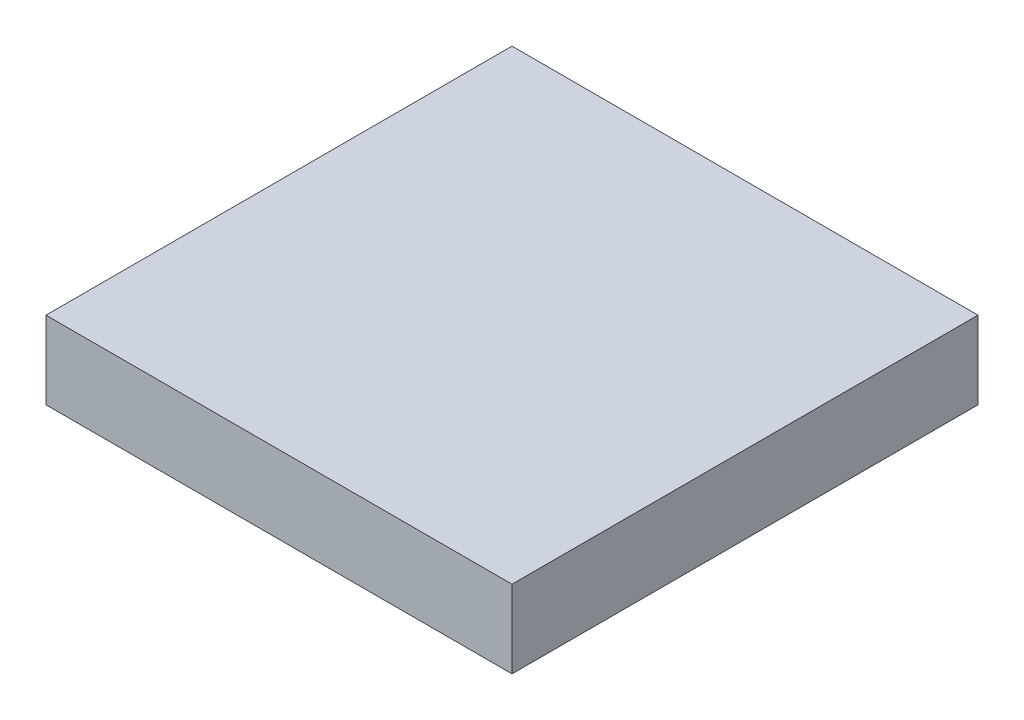
ISO-10303-21;
HEADER;
FILE_DESCRIPTION(('STEP AP214'),'2;1');
FILE_NAME('part.step','',(''),(''),'','','');
FILE_SCHEMA(('AUTOMOTIVE_DESIGN { 1 0 10303 214 1 1 1 1 }'));
ENDSEC;
DATA;
#1=APPLICATION_CONTEXT('core data for automotive mechanical design processes');
#2=APPLICATION_PROTOCOL_DEFINITION('international standard','automotive_design',2000,#1);
#3=PRODUCT_CONTEXT('',#1,'mechanical');
#4=PRODUCT('Part','Part','',(#3));
#5=PRODUCT_RELATED_PRODUCT_CATEGORY('part','',(#4));
#6=PRODUCT_DEFINITION_FORMATION('','',#4);
#7=PRODUCT_DEFINITION_CONTEXT('part definition',#1,'design');
#8=PRODUCT_DEFINITION('design','',#6,#7);
#9=PRODUCT_DEFINITION_SHAPE('','',#8);
#10=(LENGTH_UNIT() NAMED_UNIT(*) SI_UNIT(.MILLI.,.METRE.));
#11=(NAMED_UNIT(*) PLANE_ANGLE_UNIT() SI_UNIT($,.RADIAN.));
#12=(NAMED_UNIT(*) SI_UNIT($,.STERADIAN.) SOLID_ANGLE_UNIT());
#13=UNCERTAINTY_MEASURE_WITH_UNIT(LENGTH_MEASURE(1.E-05),#10,'distance_accuracy_value','');
#14=(GEOMETRIC_REPRESENTATION_CONTEXT(3) GLOBAL_UNCERTAINTY_ASSIGNED_CONTEXT((#13)) GLOBAL_UNIT_ASSIGNED_CONTEXT((#10,
#11,#12)) REPRESENTATION_CONTEXT('',''));
#15=CARTESIAN_POINT('',(0.,0.,0.));
#16=DIRECTION('',(0.,0.,1.));
#17=DIRECTION('',(1.,0.,0.));
#18=AXIS2_PLACEMENT_3D('',#15,#16,#17);
#19=CARTESIAN_POINT('',(15.,5.,-15.));
#20=DIRECTION('',(-1.,0.,0.));
#21=DIRECTION('',(0.,0.,1.));
#22=AXIS2_PLACEMENT_3D('',#19,#20,#21);
#23=PLANE('',#22);
#24=DIRECTION('',(0.,0.,-1.));
#25=VECTOR('',#24,1.);
#26=CARTESIAN_POINT('',(15.,0.,-15.));
#27=LINE('',#26,#25);
#28=CARTESIAN_POINT('',(15.,0.,15.));
#29=VERTEX_POINT('',#28);
#30=CARTESIAN_POINT('',(15.,0.,-15.));
#31=VERTEX_POINT('',#30);
#32=EDGE_CURVE('E96',#29,#31,#27,.T.);
#33=ORIENTED_EDGE('',*,*,#32,.T.);
#34=DIRECTION('',(0.,-1.,0.));
#35=VECTOR('',#34,1.);
#36=CARTESIAN_POINT('',(15.,5.,-15.));
#37=LINE('',#36,#35);
#38=CARTESIAN_POINT('',(15.,5.,-15.));
#39=VERTEX_POINT('',#38);
#40=EDGE_CURVE('E11',#39,#31,#37,.T.);
#41=ORIENTED_EDGE('',*,*,#40,.F.);
#42=DIRECTION('',(0.,0.,-1.));
#43=VECTOR('',#42,1.);
#44=CARTESIAN_POINT('',(15.,5.,-15.));
#45=LINE('',#44,#43);
#46=CARTESIAN_POINT('',(15.,5.,15.));
#47=VERTEX_POINT('',#46);
#48=EDGE_CURVE('E84',#47,#39,#45,.T.);
#49=ORIENTED_EDGE('',*,*,#48,.F.);
#50=DIRECTION('',(0.,-1.,0.));
#51=VECTOR('',#50,1.);
#52=CARTESIAN_POINT('',(15.,5.,15.));
#53=LINE('',#52,#51);
#54=EDGE_CURVE('E92',#47,#29,#53,.T.);
#55=ORIENTED_EDGE('',*,*,#54,.T.);
#56=EDGE_LOOP('',(#33,#41,#49,#55));
#57=FACE_BOUND('',#56,.T.);
#58=ADVANCED_FACE('F33',(#57),#23,.F.);
#59=CARTESIAN_POINT('',(-15.,5.,-15.));
#60=DIRECTION('',(0.,0.,1.));
#61=DIRECTION('',(1.,0.,0.));
#62=AXIS2_PLACEMENT_3D('',#59,#60,#61);
#63=PLANE('',#62);
#64=DIRECTION('',(-1.,0.,0.));
#65=VECTOR('',#64,1.);
#66=CARTESIAN_POINT('',(-15.,0.,-15.));
#67=LINE('',#66,#65);
#68=CARTESIAN_POINT('',(-15.,0.,-15.));
#69=VERTEX_POINT('',#68);
#70=EDGE_CURVE('E88',#31,#69,#67,.T.);
#71=ORIENTED_EDGE('',*,*,#70,.T.);
#72=DIRECTION('',(0.,-1.,0.));
#73=VECTOR('',#72,1.);
#74=CARTESIAN_POINT('',(-15.,5.,-15.));
#75=LINE('',#74,#73);
#76=CARTESIAN_POINT('',(-15.,5.,-15.));
#77=VERTEX_POINT('',#76);
#78=EDGE_CURVE('E41',#77,#69,#75,.T.);
#79=ORIENTED_EDGE('',*,*,#78,.F.);
#80=DIRECTION('',(-1.,0.,0.));
#81=VECTOR('',#80,1.);
#82=CARTESIAN_POINT('',(-15.,5.,-15.));
#83=LINE('',#82,#81);
#84=EDGE_CURVE('E79',#39,#77,#83,.T.);
#85=ORIENTED_EDGE('',*,*,#84,.F.);
#86=ORIENTED_EDGE('',*,*,#40,.T.);
#87=EDGE_LOOP('',(#71,#79,#85,#86));
#88=FACE_BOUND('',#87,.T.);
#89=ADVANCED_FACE('F87',(#88),#63,.F.);
#90=CARTESIAN_POINT('',(-15.,5.,-15.));
#91=DIRECTION('',(1.,0.,0.));
#92=DIRECTION('',(0.,0.,-1.));
#93=AXIS2_PLACEMENT_3D('',#90,#91,#92);
#94=PLANE('',#93);
#95=DIRECTION('',(0.,0.,1.));
#96=VECTOR('',#95,1.);
#97=CARTESIAN_POINT('',(-15.,0.,-15.));
#98=LINE('',#97,#96);
#99=CARTESIAN_POINT('',(-15.,0.,15.));
#100=VERTEX_POINT('',#99);
#101=EDGE_CURVE('E66',#69,#100,#98,.T.);
#102=ORIENTED_EDGE('',*,*,#101,.T.);
#103=DIRECTION('',(0.,-1.,0.));
#104=VECTOR('',#103,1.);
#105=CARTESIAN_POINT('',(-15.,5.,15.));
#106=LINE('',#105,#104);
#107=CARTESIAN_POINT('',(-15.,5.,15.));
#108=VERTEX_POINT('',#107);
#109=EDGE_CURVE('E89',#108,#100,#106,.T.);
#110=ORIENTED_EDGE('',*,*,#109,.F.);
#111=DIRECTION('',(0.,0.,1.));
#112=VECTOR('',#111,1.);
#113=CARTESIAN_POINT('',(-15.,5.,-15.));
#114=LINE('',#113,#112);
#115=EDGE_CURVE('E82',#77,#108,#114,.T.);
#116=ORIENTED_EDGE('',*,*,#115,.F.);
#117=ORIENTED_EDGE('',*,*,#78,.T.);
#118=EDGE_LOOP('',(#102,#110,#116,#117));
#119=FACE_BOUND('',#118,.T.);
#120=ADVANCED_FACE('F90',(#119),#94,.F.);
#121=CARTESIAN_POINT('',(-15.,5.,15.));
#122=DIRECTION('',(0.,0.,-1.));
#123=DIRECTION('',(-1.,0.,0.));
#124=AXIS2_PLACEMENT_3D('',#121,#122,#123);
#125=PLANE('',#124);
#126=DIRECTION('',(1.,0.,0.));
#127=VECTOR('',#126,1.);
#128=CARTESIAN_POINT('',(-15.,0.,15.));
#129=LINE('',#128,#127);
#130=EDGE_CURVE('E72',#100,#29,#129,.T.);
#131=ORIENTED_EDGE('',*,*,#130,.T.);
#132=ORIENTED_EDGE('',*,*,#54,.F.);
#133=DIRECTION('',(1.,0.,0.));
#134=VECTOR('',#133,1.);
#135=CARTESIAN_POINT('',(-15.,5.,15.));
#136=LINE('',#135,#134);
#137=EDGE_CURVE('E49',#108,#47,#136,.T.);
#138=ORIENTED_EDGE('',*,*,#137,.F.);
#139=ORIENTED_EDGE('',*,*,#109,.T.);
#140=EDGE_LOOP('',(#131,#132,#138,#139));
#141=FACE_BOUND('',#140,.T.);
#142=ADVANCED_FACE('F103',(#141),#125,.F.);
#143=CARTESIAN_POINT('',(0.,5.,0.));
#144=DIRECTION('',(0.,1.,0.));
#145=DIRECTION('',(0.,0.,1.));
#146=AXIS2_PLACEMENT_3D('',#143,#144,#145);
#147=PLANE('',#146);
#148=ORIENTED_EDGE('',*,*,#48,.T.);
#149=ORIENTED_EDGE('',*,*,#84,.T.);
#150=ORIENTED_EDGE('',*,*,#115,.T.);
#151=ORIENTED_EDGE('',*,*,#137,.T.);
#152=EDGE_LOOP('',(#148,#149,#150,#151));
#153=FACE_BOUND('',#152,.T.);
#154=ADVANCED_FACE('F80',(#153),#147,.T.);
#155=CARTESIAN_POINT('',(0.,0.,0.));
#156=DIRECTION('',(0.,1.,0.));
#157=DIRECTION('',(0.,0.,1.));
#158=AXIS2_PLACEMENT_3D('',#155,#156,#157);
#159=PLANE('',#158);
#160=ORIENTED_EDGE('',*,*,#32,.F.);
#161=ORIENTED_EDGE('',*,*,#130,.F.);
#162=ORIENTED_EDGE('',*,*,#101,.F.);
#163=ORIENTED_EDGE('',*,*,#70,.F.);
#164=EDGE_LOOP('',(#160,#161,#162,#163));
#165=FACE_BOUND('',#164,.T.);
#166=ADVANCED_FACE('F106',(#165),#159,.F.);
#167=CLOSED_SHELL('',(#58,#89,#120,#142,#154,#166));
#168=MANIFOLD_SOLID_BREP('B2',#167);
#169=ADVANCED_BREP_SHAPE_REPRESENTATION('',(#18,#168),#14);
#170=SHAPE_DEFINITION_REPRESENTATION(#9,#169);
ENDSEC;
END-ISO-10303-21;
